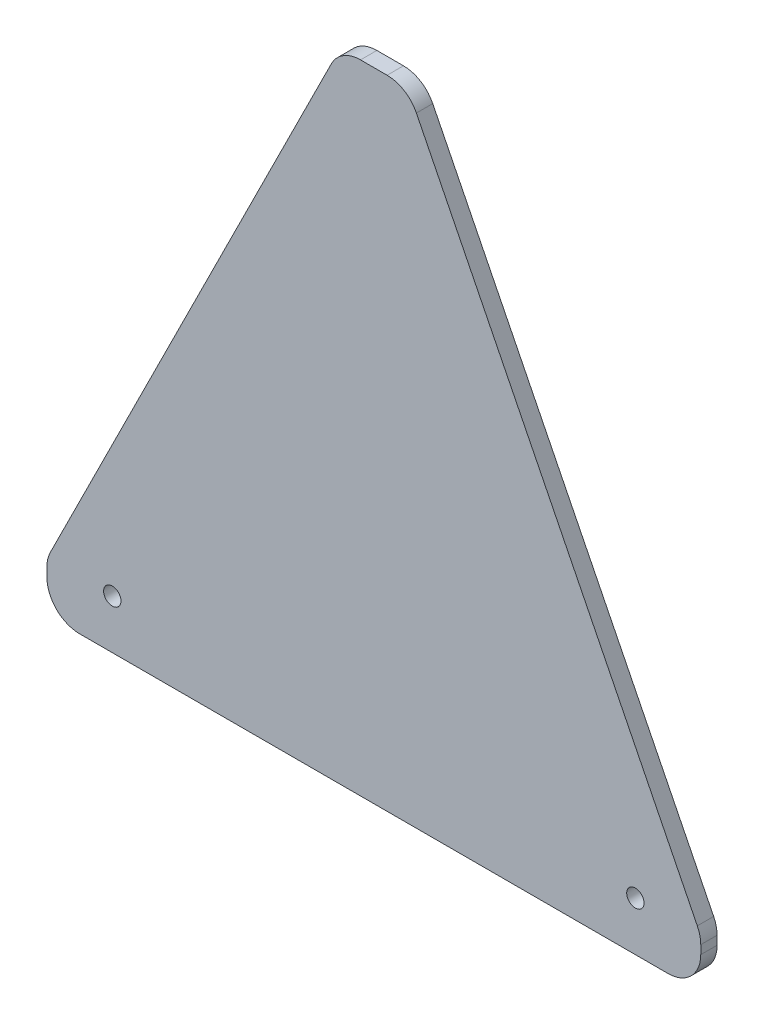
ISO-10303-21;
HEADER;
FILE_DESCRIPTION(('STEP AP214'),'2;1');
FILE_NAME('part.step','',(''),(''),'','','');
FILE_SCHEMA(('AUTOMOTIVE_DESIGN { 1 0 10303 214 1 1 1 1 }'));
ENDSEC;
DATA;
#1=APPLICATION_CONTEXT('core data for automotive mechanical design processes');
#2=APPLICATION_PROTOCOL_DEFINITION('international standard','automotive_design',2000,#1);
#3=PRODUCT_CONTEXT('',#1,'mechanical');
#4=PRODUCT('Part','Part','',(#3));
#5=PRODUCT_RELATED_PRODUCT_CATEGORY('part','',(#4));
#6=PRODUCT_DEFINITION_FORMATION('','',#4);
#7=PRODUCT_DEFINITION_CONTEXT('part definition',#1,'design');
#8=PRODUCT_DEFINITION('design','',#6,#7);
#9=PRODUCT_DEFINITION_SHAPE('','',#8);
#10=(LENGTH_UNIT() NAMED_UNIT(*) SI_UNIT(.MILLI.,.METRE.));
#11=(NAMED_UNIT(*) PLANE_ANGLE_UNIT() SI_UNIT($,.RADIAN.));
#12=(NAMED_UNIT(*) SI_UNIT($,.STERADIAN.) SOLID_ANGLE_UNIT());
#13=UNCERTAINTY_MEASURE_WITH_UNIT(LENGTH_MEASURE(1.E-05),#10,'distance_accuracy_value','');
#14=(GEOMETRIC_REPRESENTATION_CONTEXT(3) GLOBAL_UNCERTAINTY_ASSIGNED_CONTEXT((#13)) GLOBAL_UNIT_ASSIGNED_CONTEXT((#10,
#11,#12)) REPRESENTATION_CONTEXT('',''));
#15=CARTESIAN_POINT('',(0.,0.,0.));
#16=DIRECTION('',(0.,0.,1.));
#17=DIRECTION('',(1.,0.,0.));
#18=AXIS2_PLACEMENT_3D('',#15,#16,#17);
#19=CARTESIAN_POINT('',(0.,0.,6.35));
#20=DIRECTION('',(0.,0.,-1.));
#21=DIRECTION('',(-1.,0.,0.));
#22=AXIS2_PLACEMENT_3D('',#19,#20,#21);
#23=PLANE('',#22);
#24=DIRECTION('',(-1.,0.,0.));
#25=VECTOR('',#24,1.);
#26=CARTESIAN_POINT('',(113.975755601014,247.65,6.35));
#27=LINE('',#26,#25);
#28=CARTESIAN_POINT('',(132.165245934657,247.65,6.35));
#29=VERTEX_POINT('',#28);
#30=CARTESIAN_POINT('',(121.834754065343,247.65,6.35));
#31=VERTEX_POINT('',#30);
#32=EDGE_CURVE('E234',#29,#31,#27,.T.);
#33=ORIENTED_EDGE('',*,*,#32,.T.);
#34=CARTESIAN_POINT('',(121.834754065343,234.95,6.35));
#35=DIRECTION('',(0.,0.,-1.));
#36=DIRECTION('',(-1.,0.,0.));
#37=AXIS2_PLACEMENT_3D('',#34,#35,#36);
#38=CIRCLE('',#37,12.7);
#39=CARTESIAN_POINT('',(110.469087672997,240.616712226495,6.35));
#40=VERTEX_POINT('',#39);
#41=EDGE_CURVE('E185',#31,#40,#38,.F.);
#42=ORIENTED_EDGE('',*,*,#41,.T.);
#43=DIRECTION('',(-0.446197813109806,-0.894934361602026,0.));
#44=VECTOR('',#43,1.);
#45=CARTESIAN_POINT('',(0.,19.05,6.35));
#46=LINE('',#45,#44);
#47=CARTESIAN_POINT('',(1.33433360765427,21.7262591842563,6.35));
#48=VERTEX_POINT('',#47);
#49=EDGE_CURVE('E147',#40,#48,#46,.T.);
#50=ORIENTED_EDGE('',*,*,#49,.T.);
#51=CARTESIAN_POINT('',(12.7,16.0595469577618,6.35));
#52=DIRECTION('',(0.,0.,-1.));
#53=DIRECTION('',(-1.,0.,0.));
#54=AXIS2_PLACEMENT_3D('',#51,#52,#53);
#55=CIRCLE('',#54,12.7);
#56=CARTESIAN_POINT('',(0.,16.0595469577618,6.35));
#57=VERTEX_POINT('',#56);
#58=EDGE_CURVE('E176',#48,#57,#55,.F.);
#59=ORIENTED_EDGE('',*,*,#58,.T.);
#60=DIRECTION('',(0.,-1.,0.));
#61=VECTOR('',#60,1.);
#62=CARTESIAN_POINT('',(0.,0.,6.35));
#63=LINE('',#62,#61);
#64=CARTESIAN_POINT('',(0.,12.7,6.35));
#65=VERTEX_POINT('',#64);
#66=EDGE_CURVE('E154',#57,#65,#63,.T.);
#67=ORIENTED_EDGE('',*,*,#66,.T.);
#68=CARTESIAN_POINT('',(12.7,12.7,6.35));
#69=DIRECTION('',(0.,0.,-1.));
#70=DIRECTION('',(-1.,0.,0.));
#71=AXIS2_PLACEMENT_3D('',#68,#69,#70);
#72=CIRCLE('',#71,12.7);
#73=CARTESIAN_POINT('',(12.7,0.,6.35));
#74=VERTEX_POINT('',#73);
#75=EDGE_CURVE('E178',#65,#74,#72,.F.);
#76=ORIENTED_EDGE('',*,*,#75,.T.);
#77=DIRECTION('',(1.,0.,0.));
#78=VECTOR('',#77,1.);
#79=CARTESIAN_POINT('',(0.,0.,6.35));
#80=LINE('',#79,#78);
#81=CARTESIAN_POINT('',(241.3,0.,6.35));
#82=VERTEX_POINT('',#81);
#83=EDGE_CURVE('E158',#74,#82,#80,.T.);
#84=ORIENTED_EDGE('',*,*,#83,.T.);
#85=CARTESIAN_POINT('',(241.3,12.7,6.35));
#86=DIRECTION('',(0.,0.,-1.));
#87=DIRECTION('',(-1.,0.,0.));
#88=AXIS2_PLACEMENT_3D('',#85,#86,#87);
#89=CIRCLE('',#88,12.7);
#90=CARTESIAN_POINT('',(254.,12.7,6.35));
#91=VERTEX_POINT('',#90);
#92=EDGE_CURVE('E180',#82,#91,#89,.F.);
#93=ORIENTED_EDGE('',*,*,#92,.T.);
#94=DIRECTION('',(0.,1.,0.));
#95=VECTOR('',#94,1.);
#96=CARTESIAN_POINT('',(254.,0.,6.35));
#97=LINE('',#96,#95);
#98=CARTESIAN_POINT('',(254.,16.0595469577617,6.35));
#99=VERTEX_POINT('',#98);
#100=EDGE_CURVE('E238',#91,#99,#97,.T.);
#101=ORIENTED_EDGE('',*,*,#100,.T.);
#102=CARTESIAN_POINT('',(241.3,16.0595469577617,6.35));
#103=DIRECTION('',(0.,0.,-1.));
#104=DIRECTION('',(-1.,0.,0.));
#105=AXIS2_PLACEMENT_3D('',#102,#103,#104);
#106=CIRCLE('',#105,12.7);
#107=CARTESIAN_POINT('',(252.665666392346,21.7262591842563,6.35));
#108=VERTEX_POINT('',#107);
#109=EDGE_CURVE('E59',#99,#108,#106,.F.);
#110=ORIENTED_EDGE('',*,*,#109,.T.);
#111=DIRECTION('',(-0.446197813109806,0.894934361602026,0.));
#112=VECTOR('',#111,1.);
#113=CARTESIAN_POINT('',(140.024244398986,247.65,6.35));
#114=LINE('',#113,#112);
#115=CARTESIAN_POINT('',(143.530912327003,240.616712226495,6.35));
#116=VERTEX_POINT('',#115);
#117=EDGE_CURVE('E235',#108,#116,#114,.T.);
#118=ORIENTED_EDGE('',*,*,#117,.T.);
#119=CARTESIAN_POINT('',(132.165245934657,234.95,6.35));
#120=DIRECTION('',(0.,0.,-1.));
#121=DIRECTION('',(-1.,0.,0.));
#122=AXIS2_PLACEMENT_3D('',#119,#120,#121);
#123=CIRCLE('',#122,12.7);
#124=EDGE_CURVE('E183',#116,#29,#123,.F.);
#125=ORIENTED_EDGE('',*,*,#124,.T.);
#126=EDGE_LOOP('',(#33,#42,#50,#59,#67,#76,#84,#93,#101,#110,#118,#125));
#127=FACE_BOUND('',#126,.T.);
#128=CARTESIAN_POINT('',(25.4,19.05,6.35));
#129=DIRECTION('',(0.,0.,1.));
#130=DIRECTION('',(1.,0.,0.));
#131=AXIS2_PLACEMENT_3D('',#128,#129,#130);
#132=CIRCLE('',#131,3.3734375);
#133=CARTESIAN_POINT('',(28.7734375,19.05,6.35));
#134=VERTEX_POINT('',#133);
#135=EDGE_CURVE('E212',#134,#134,#132,.T.);
#136=ORIENTED_EDGE('',*,*,#135,.F.);
#137=EDGE_LOOP('',(#136));
#138=FACE_BOUND('',#137,.T.);
#139=CARTESIAN_POINT('',(228.6,19.05,6.35));
#140=DIRECTION('',(0.,0.,1.));
#141=DIRECTION('',(1.,0.,0.));
#142=AXIS2_PLACEMENT_3D('',#139,#140,#141);
#143=CIRCLE('',#142,3.37343750000003);
#144=CARTESIAN_POINT('',(231.9734375,19.05,6.35));
#145=VERTEX_POINT('',#144);
#146=EDGE_CURVE('E245',#145,#145,#143,.T.);
#147=ORIENTED_EDGE('',*,*,#146,.F.);
#148=EDGE_LOOP('',(#147));
#149=FACE_BOUND('',#148,.T.);
#150=ADVANCED_FACE('F37',(#127,#138,#149),#23,.F.);
#151=CARTESIAN_POINT('',(0.,0.,0.));
#152=DIRECTION('',(0.,0.,-1.));
#153=DIRECTION('',(-1.,0.,0.));
#154=AXIS2_PLACEMENT_3D('',#151,#152,#153);
#155=PLANE('',#154);
#156=CARTESIAN_POINT('',(25.4,19.05,0.));
#157=DIRECTION('',(0.,0.,1.));
#158=DIRECTION('',(1.,0.,0.));
#159=AXIS2_PLACEMENT_3D('',#156,#157,#158);
#160=CIRCLE('',#159,3.3734375);
#161=CARTESIAN_POINT('',(28.7734375,19.05,0.));
#162=VERTEX_POINT('',#161);
#163=EDGE_CURVE('E218',#162,#162,#160,.T.);
#164=ORIENTED_EDGE('',*,*,#163,.T.);
#165=EDGE_LOOP('',(#164));
#166=FACE_BOUND('',#165,.T.);
#167=DIRECTION('',(-0.446197813109806,-0.894934361602026,0.));
#168=VECTOR('',#167,1.);
#169=CARTESIAN_POINT('',(0.,19.05,0.));
#170=LINE('',#169,#168);
#171=CARTESIAN_POINT('',(110.469087672997,240.616712226495,0.));
#172=VERTEX_POINT('',#171);
#173=CARTESIAN_POINT('',(1.33433360765427,21.7262591842563,0.));
#174=VERTEX_POINT('',#173);
#175=EDGE_CURVE('E144',#172,#174,#170,.T.);
#176=ORIENTED_EDGE('',*,*,#175,.F.);
#177=CARTESIAN_POINT('',(121.834754065343,234.95,0.));
#178=DIRECTION('',(0.,0.,-1.));
#179=DIRECTION('',(-1.,0.,0.));
#180=AXIS2_PLACEMENT_3D('',#177,#178,#179);
#181=CIRCLE('',#180,12.7);
#182=CARTESIAN_POINT('',(121.834754065343,247.65,0.));
#183=VERTEX_POINT('',#182);
#184=EDGE_CURVE('E127',#172,#183,#181,.T.);
#185=ORIENTED_EDGE('',*,*,#184,.T.);
#186=DIRECTION('',(-1.,0.,0.));
#187=VECTOR('',#186,1.);
#188=CARTESIAN_POINT('',(113.975755601014,247.65,0.));
#189=LINE('',#188,#187);
#190=CARTESIAN_POINT('',(132.165245934657,247.65,0.));
#191=VERTEX_POINT('',#190);
#192=EDGE_CURVE('E155',#191,#183,#189,.T.);
#193=ORIENTED_EDGE('',*,*,#192,.F.);
#194=CARTESIAN_POINT('',(132.165245934657,234.95,0.));
#195=DIRECTION('',(0.,0.,-1.));
#196=DIRECTION('',(-1.,0.,0.));
#197=AXIS2_PLACEMENT_3D('',#194,#195,#196);
#198=CIRCLE('',#197,12.7);
#199=CARTESIAN_POINT('',(143.530912327003,240.616712226495,0.));
#200=VERTEX_POINT('',#199);
#201=EDGE_CURVE('E138',#191,#200,#198,.T.);
#202=ORIENTED_EDGE('',*,*,#201,.T.);
#203=DIRECTION('',(-0.446197813109806,0.894934361602026,0.));
#204=VECTOR('',#203,1.);
#205=CARTESIAN_POINT('',(140.024244398986,247.65,0.));
#206=LINE('',#205,#204);
#207=CARTESIAN_POINT('',(252.665666392346,21.7262591842563,0.));
#208=VERTEX_POINT('',#207);
#209=EDGE_CURVE('E160',#208,#200,#206,.T.);
#210=ORIENTED_EDGE('',*,*,#209,.F.);
#211=CARTESIAN_POINT('',(241.3,16.0595469577617,0.));
#212=DIRECTION('',(0.,0.,-1.));
#213=DIRECTION('',(-1.,0.,0.));
#214=AXIS2_PLACEMENT_3D('',#211,#212,#213);
#215=CIRCLE('',#214,12.7);
#216=CARTESIAN_POINT('',(254.,16.0595469577617,0.));
#217=VERTEX_POINT('',#216);
#218=EDGE_CURVE('E170',#208,#217,#215,.T.);
#219=ORIENTED_EDGE('',*,*,#218,.T.);
#220=DIRECTION('',(0.,1.,0.));
#221=VECTOR('',#220,1.);
#222=CARTESIAN_POINT('',(254.,0.,0.));
#223=LINE('',#222,#221);
#224=CARTESIAN_POINT('',(254.,12.7,0.));
#225=VERTEX_POINT('',#224);
#226=EDGE_CURVE('E215',#225,#217,#223,.T.);
#227=ORIENTED_EDGE('',*,*,#226,.F.);
#228=CARTESIAN_POINT('',(241.3,12.7,0.));
#229=DIRECTION('',(0.,0.,-1.));
#230=DIRECTION('',(-1.,0.,0.));
#231=AXIS2_PLACEMENT_3D('',#228,#229,#230);
#232=CIRCLE('',#231,12.7);
#233=CARTESIAN_POINT('',(241.3,0.,0.));
#234=VERTEX_POINT('',#233);
#235=EDGE_CURVE('E168',#225,#234,#232,.T.);
#236=ORIENTED_EDGE('',*,*,#235,.T.);
#237=DIRECTION('',(1.,0.,0.));
#238=VECTOR('',#237,1.);
#239=CARTESIAN_POINT('',(0.,0.,0.));
#240=LINE('',#239,#238);
#241=CARTESIAN_POINT('',(12.7,0.,0.));
#242=VERTEX_POINT('',#241);
#243=EDGE_CURVE('E211',#242,#234,#240,.T.);
#244=ORIENTED_EDGE('',*,*,#243,.F.);
#245=CARTESIAN_POINT('',(12.7,12.7,0.));
#246=DIRECTION('',(0.,0.,-1.));
#247=DIRECTION('',(-1.,0.,0.));
#248=AXIS2_PLACEMENT_3D('',#245,#246,#247);
#249=CIRCLE('',#248,12.7);
#250=CARTESIAN_POINT('',(0.,12.7,0.));
#251=VERTEX_POINT('',#250);
#252=EDGE_CURVE('E166',#242,#251,#249,.T.);
#253=ORIENTED_EDGE('',*,*,#252,.T.);
#254=DIRECTION('',(0.,-1.,0.));
#255=VECTOR('',#254,1.);
#256=CARTESIAN_POINT('',(0.,0.,0.));
#257=LINE('',#256,#255);
#258=CARTESIAN_POINT('',(0.,16.0595469577618,0.));
#259=VERTEX_POINT('',#258);
#260=EDGE_CURVE('E206',#259,#251,#257,.T.);
#261=ORIENTED_EDGE('',*,*,#260,.F.);
#262=CARTESIAN_POINT('',(12.7,16.0595469577618,0.));
#263=DIRECTION('',(0.,0.,-1.));
#264=DIRECTION('',(-1.,0.,0.));
#265=AXIS2_PLACEMENT_3D('',#262,#263,#264);
#266=CIRCLE('',#265,12.7);
#267=EDGE_CURVE('E148',#259,#174,#266,.T.);
#268=ORIENTED_EDGE('',*,*,#267,.T.);
#269=EDGE_LOOP('',(#176,#185,#193,#202,#210,#219,#227,#236,#244,#253,#261,#268));
#270=FACE_BOUND('',#269,.T.);
#271=CARTESIAN_POINT('',(228.6,19.05,0.));
#272=DIRECTION('',(0.,0.,1.));
#273=DIRECTION('',(1.,0.,0.));
#274=AXIS2_PLACEMENT_3D('',#271,#272,#273);
#275=CIRCLE('',#274,3.37343750000003);
#276=CARTESIAN_POINT('',(231.9734375,19.05,0.));
#277=VERTEX_POINT('',#276);
#278=EDGE_CURVE('E247',#277,#277,#275,.T.);
#279=ORIENTED_EDGE('',*,*,#278,.T.);
#280=EDGE_LOOP('',(#279));
#281=FACE_BOUND('',#280,.T.);
#282=ADVANCED_FACE('F151',(#166,#270,#281),#155,.T.);
#283=CARTESIAN_POINT('',(0.,0.,6.35));
#284=DIRECTION('',(1.,0.,0.));
#285=DIRECTION('',(0.,0.,-1.));
#286=AXIS2_PLACEMENT_3D('',#283,#284,#285);
#287=PLANE('',#286);
#288=ORIENTED_EDGE('',*,*,#260,.T.);
#289=DIRECTION('',(0.,0.,-1.));
#290=VECTOR('',#289,1.);
#291=CARTESIAN_POINT('',(0.,12.7,6.35));
#292=LINE('',#291,#290);
#293=EDGE_CURVE('E11',#251,#65,#292,.F.);
#294=ORIENTED_EDGE('',*,*,#293,.T.);
#295=ORIENTED_EDGE('',*,*,#66,.F.);
#296=DIRECTION('',(0.,0.,-1.));
#297=VECTOR('',#296,1.);
#298=CARTESIAN_POINT('',(0.,16.0595469577618,6.35));
#299=LINE('',#298,#297);
#300=EDGE_CURVE('E45',#57,#259,#299,.T.);
#301=ORIENTED_EDGE('',*,*,#300,.T.);
#302=EDGE_LOOP('',(#288,#294,#295,#301));
#303=FACE_BOUND('',#302,.T.);
#304=ADVANCED_FACE('F205',(#303),#287,.F.);
#305=CARTESIAN_POINT('',(0.,0.,6.35));
#306=DIRECTION('',(0.,1.,0.));
#307=DIRECTION('',(0.,0.,1.));
#308=AXIS2_PLACEMENT_3D('',#305,#306,#307);
#309=PLANE('',#308);
#310=ORIENTED_EDGE('',*,*,#243,.T.);
#311=DIRECTION('',(0.,0.,-1.));
#312=VECTOR('',#311,1.);
#313=CARTESIAN_POINT('',(241.3,0.,6.35));
#314=LINE('',#313,#312);
#315=EDGE_CURVE('E199',#234,#82,#314,.F.);
#316=ORIENTED_EDGE('',*,*,#315,.T.);
#317=ORIENTED_EDGE('',*,*,#83,.F.);
#318=DIRECTION('',(0.,0.,-1.));
#319=VECTOR('',#318,1.);
#320=CARTESIAN_POINT('',(12.7,0.,6.35));
#321=LINE('',#320,#319);
#322=EDGE_CURVE('E196',#74,#242,#321,.T.);
#323=ORIENTED_EDGE('',*,*,#322,.T.);
#324=EDGE_LOOP('',(#310,#316,#317,#323));
#325=FACE_BOUND('',#324,.T.);
#326=ADVANCED_FACE('F277',(#325),#309,.F.);
#327=CARTESIAN_POINT('',(254.,0.,6.35));
#328=DIRECTION('',(-1.,0.,0.));
#329=DIRECTION('',(0.,0.,1.));
#330=AXIS2_PLACEMENT_3D('',#327,#328,#329);
#331=PLANE('',#330);
#332=ORIENTED_EDGE('',*,*,#226,.T.);
#333=DIRECTION('',(0.,0.,-1.));
#334=VECTOR('',#333,1.);
#335=CARTESIAN_POINT('',(254.,16.0595469577617,6.35));
#336=LINE('',#335,#334);
#337=EDGE_CURVE('E194',#217,#99,#336,.F.);
#338=ORIENTED_EDGE('',*,*,#337,.T.);
#339=ORIENTED_EDGE('',*,*,#100,.F.);
#340=DIRECTION('',(0.,0.,-1.));
#341=VECTOR('',#340,1.);
#342=CARTESIAN_POINT('',(254.,12.7,6.35));
#343=LINE('',#342,#341);
#344=EDGE_CURVE('E191',#91,#225,#343,.T.);
#345=ORIENTED_EDGE('',*,*,#344,.T.);
#346=EDGE_LOOP('',(#332,#338,#339,#345));
#347=FACE_BOUND('',#346,.T.);
#348=ADVANCED_FACE('F274',(#347),#331,.F.);
#349=CARTESIAN_POINT('',(140.024244398986,247.65,6.35));
#350=DIRECTION('',(-0.894934361602026,-0.446197813109806,0.));
#351=DIRECTION('',(0.446197813109806,-0.894934361602026,0.));
#352=AXIS2_PLACEMENT_3D('',#349,#350,#351);
#353=PLANE('',#352);
#354=ORIENTED_EDGE('',*,*,#209,.T.);
#355=DIRECTION('',(0.,0.,-1.));
#356=VECTOR('',#355,1.);
#357=CARTESIAN_POINT('',(143.530912327003,240.616712226495,6.35));
#358=LINE('',#357,#356);
#359=EDGE_CURVE('E52',#200,#116,#358,.F.);
#360=ORIENTED_EDGE('',*,*,#359,.T.);
#361=ORIENTED_EDGE('',*,*,#117,.F.);
#362=DIRECTION('',(0.,0.,-1.));
#363=VECTOR('',#362,1.);
#364=CARTESIAN_POINT('',(252.665666392346,21.7262591842563,6.35));
#365=LINE('',#364,#363);
#366=EDGE_CURVE('E187',#108,#208,#365,.T.);
#367=ORIENTED_EDGE('',*,*,#366,.T.);
#368=EDGE_LOOP('',(#354,#360,#361,#367));
#369=FACE_BOUND('',#368,.T.);
#370=ADVANCED_FACE('F225',(#369),#353,.F.);
#371=CARTESIAN_POINT('',(113.975755601014,247.65,6.35));
#372=DIRECTION('',(0.,-1.,0.));
#373=DIRECTION('',(0.,0.,-1.));
#374=AXIS2_PLACEMENT_3D('',#371,#372,#373);
#375=PLANE('',#374);
#376=ORIENTED_EDGE('',*,*,#192,.T.);
#377=DIRECTION('',(0.,0.,-1.));
#378=VECTOR('',#377,1.);
#379=CARTESIAN_POINT('',(121.834754065343,247.65,6.35));
#380=LINE('',#379,#378);
#381=EDGE_CURVE('E132',#183,#31,#380,.F.);
#382=ORIENTED_EDGE('',*,*,#381,.T.);
#383=ORIENTED_EDGE('',*,*,#32,.F.);
#384=DIRECTION('',(0.,0.,-1.));
#385=VECTOR('',#384,1.);
#386=CARTESIAN_POINT('',(132.165245934657,247.65,6.35));
#387=LINE('',#386,#385);
#388=EDGE_CURVE('E137',#29,#191,#387,.T.);
#389=ORIENTED_EDGE('',*,*,#388,.T.);
#390=EDGE_LOOP('',(#376,#382,#383,#389));
#391=FACE_BOUND('',#390,.T.);
#392=ADVANCED_FACE('F237',(#391),#375,.F.);
#393=CARTESIAN_POINT('',(0.,19.05,6.35));
#394=DIRECTION('',(0.894934361602026,-0.446197813109806,0.));
#395=DIRECTION('',(0.446197813109806,0.894934361602026,0.));
#396=AXIS2_PLACEMENT_3D('',#393,#394,#395);
#397=PLANE('',#396);
#398=ORIENTED_EDGE('',*,*,#49,.F.);
#399=DIRECTION('',(0.,0.,-1.));
#400=VECTOR('',#399,1.);
#401=CARTESIAN_POINT('',(110.469087672997,240.616712226495,6.35));
#402=LINE('',#401,#400);
#403=EDGE_CURVE('E131',#40,#172,#402,.T.);
#404=ORIENTED_EDGE('',*,*,#403,.T.);
#405=ORIENTED_EDGE('',*,*,#175,.T.);
#406=DIRECTION('',(0.,0.,-1.));
#407=VECTOR('',#406,1.);
#408=CARTESIAN_POINT('',(1.33433360765427,21.7262591842563,6.35));
#409=LINE('',#408,#407);
#410=EDGE_CURVE('E149',#174,#48,#409,.F.);
#411=ORIENTED_EDGE('',*,*,#410,.T.);
#412=EDGE_LOOP('',(#398,#404,#405,#411));
#413=FACE_BOUND('',#412,.T.);
#414=ADVANCED_FACE('F143',(#413),#397,.F.);
#415=CARTESIAN_POINT('',(25.4,19.05,6.35));
#416=DIRECTION('',(0.,0.,-1.));
#417=DIRECTION('',(-1.,0.,0.));
#418=AXIS2_PLACEMENT_3D('',#415,#416,#417);
#419=CYLINDRICAL_SURFACE('',#418,3.3734375);
#420=ORIENTED_EDGE('',*,*,#135,.T.);
#421=EDGE_LOOP('',(#420));
#422=FACE_BOUND('',#421,.T.);
#423=ORIENTED_EDGE('',*,*,#163,.F.);
#424=EDGE_LOOP('',(#423));
#425=FACE_BOUND('',#424,.T.);
#426=ADVANCED_FACE('F265',(#422,#425),#419,.F.);
#427=CARTESIAN_POINT('',(228.6,19.05,6.35));
#428=DIRECTION('',(0.,0.,-1.));
#429=DIRECTION('',(-1.,0.,0.));
#430=AXIS2_PLACEMENT_3D('',#427,#428,#429);
#431=CYLINDRICAL_SURFACE('',#430,3.37343750000003);
#432=ORIENTED_EDGE('',*,*,#146,.T.);
#433=EDGE_LOOP('',(#432));
#434=FACE_BOUND('',#433,.T.);
#435=ORIENTED_EDGE('',*,*,#278,.F.);
#436=EDGE_LOOP('',(#435));
#437=FACE_BOUND('',#436,.T.);
#438=ADVANCED_FACE('F253',(#434,#437),#431,.F.);
#439=CARTESIAN_POINT('',(121.834754065343,234.95,6.35));
#440=DIRECTION('',(0.,0.,-1.));
#441=DIRECTION('',(-1.,0.,0.));
#442=AXIS2_PLACEMENT_3D('',#439,#440,#441);
#443=CYLINDRICAL_SURFACE('',#442,12.7);
#444=ORIENTED_EDGE('',*,*,#41,.F.);
#445=ORIENTED_EDGE('',*,*,#381,.F.);
#446=ORIENTED_EDGE('',*,*,#184,.F.);
#447=ORIENTED_EDGE('',*,*,#403,.F.);
#448=EDGE_LOOP('',(#444,#445,#446,#447));
#449=FACE_BOUND('',#448,.T.);
#450=ADVANCED_FACE('F130',(#449),#443,.T.);
#451=CARTESIAN_POINT('',(132.165245934657,234.95,6.35));
#452=DIRECTION('',(0.,0.,-1.));
#453=DIRECTION('',(-1.,0.,0.));
#454=AXIS2_PLACEMENT_3D('',#451,#452,#453);
#455=CYLINDRICAL_SURFACE('',#454,12.7);
#456=ORIENTED_EDGE('',*,*,#124,.F.);
#457=ORIENTED_EDGE('',*,*,#359,.F.);
#458=ORIENTED_EDGE('',*,*,#201,.F.);
#459=ORIENTED_EDGE('',*,*,#388,.F.);
#460=EDGE_LOOP('',(#456,#457,#458,#459));
#461=FACE_BOUND('',#460,.T.);
#462=ADVANCED_FACE('F229',(#461),#455,.T.);
#463=CARTESIAN_POINT('',(241.3,16.0595469577617,6.35));
#464=DIRECTION('',(0.,0.,-1.));
#465=DIRECTION('',(-1.,0.,0.));
#466=AXIS2_PLACEMENT_3D('',#463,#464,#465);
#467=CYLINDRICAL_SURFACE('',#466,12.7);
#468=ORIENTED_EDGE('',*,*,#109,.F.);
#469=ORIENTED_EDGE('',*,*,#337,.F.);
#470=ORIENTED_EDGE('',*,*,#218,.F.);
#471=ORIENTED_EDGE('',*,*,#366,.F.);
#472=EDGE_LOOP('',(#468,#469,#470,#471));
#473=FACE_BOUND('',#472,.T.);
#474=ADVANCED_FACE('F288',(#473),#467,.T.);
#475=CARTESIAN_POINT('',(241.3,12.7,6.35));
#476=DIRECTION('',(0.,0.,-1.));
#477=DIRECTION('',(-1.,0.,0.));
#478=AXIS2_PLACEMENT_3D('',#475,#476,#477);
#479=CYLINDRICAL_SURFACE('',#478,12.7);
#480=ORIENTED_EDGE('',*,*,#92,.F.);
#481=ORIENTED_EDGE('',*,*,#315,.F.);
#482=ORIENTED_EDGE('',*,*,#235,.F.);
#483=ORIENTED_EDGE('',*,*,#344,.F.);
#484=EDGE_LOOP('',(#480,#481,#482,#483));
#485=FACE_BOUND('',#484,.T.);
#486=ADVANCED_FACE('F291',(#485),#479,.T.);
#487=CARTESIAN_POINT('',(12.7,12.7,6.35));
#488=DIRECTION('',(0.,0.,-1.));
#489=DIRECTION('',(-1.,0.,0.));
#490=AXIS2_PLACEMENT_3D('',#487,#488,#489);
#491=CYLINDRICAL_SURFACE('',#490,12.7);
#492=ORIENTED_EDGE('',*,*,#75,.F.);
#493=ORIENTED_EDGE('',*,*,#293,.F.);
#494=ORIENTED_EDGE('',*,*,#252,.F.);
#495=ORIENTED_EDGE('',*,*,#322,.F.);
#496=EDGE_LOOP('',(#492,#493,#494,#495));
#497=FACE_BOUND('',#496,.T.);
#498=ADVANCED_FACE('F294',(#497),#491,.T.);
#499=CARTESIAN_POINT('',(12.7,16.0595469577618,6.35));
#500=DIRECTION('',(0.,0.,-1.));
#501=DIRECTION('',(-1.,0.,0.));
#502=AXIS2_PLACEMENT_3D('',#499,#500,#501);
#503=CYLINDRICAL_SURFACE('',#502,12.7);
#504=ORIENTED_EDGE('',*,*,#58,.F.);
#505=ORIENTED_EDGE('',*,*,#410,.F.);
#506=ORIENTED_EDGE('',*,*,#267,.F.);
#507=ORIENTED_EDGE('',*,*,#300,.F.);
#508=EDGE_LOOP('',(#504,#505,#506,#507));
#509=FACE_BOUND('',#508,.T.);
#510=ADVANCED_FACE('F39',(#509),#503,.T.);
#511=CLOSED_SHELL('',(#150,#282,#304,#326,#348,#370,#392,#414,#426,#438,#450,#462,#474,#486,
#498,#510));
#512=MANIFOLD_SOLID_BREP('B2',#511);
#513=ADVANCED_BREP_SHAPE_REPRESENTATION('',(#18,#512),#14);
#514=SHAPE_DEFINITION_REPRESENTATION(#9,#513);
ENDSEC;
END-ISO-10303-21;
